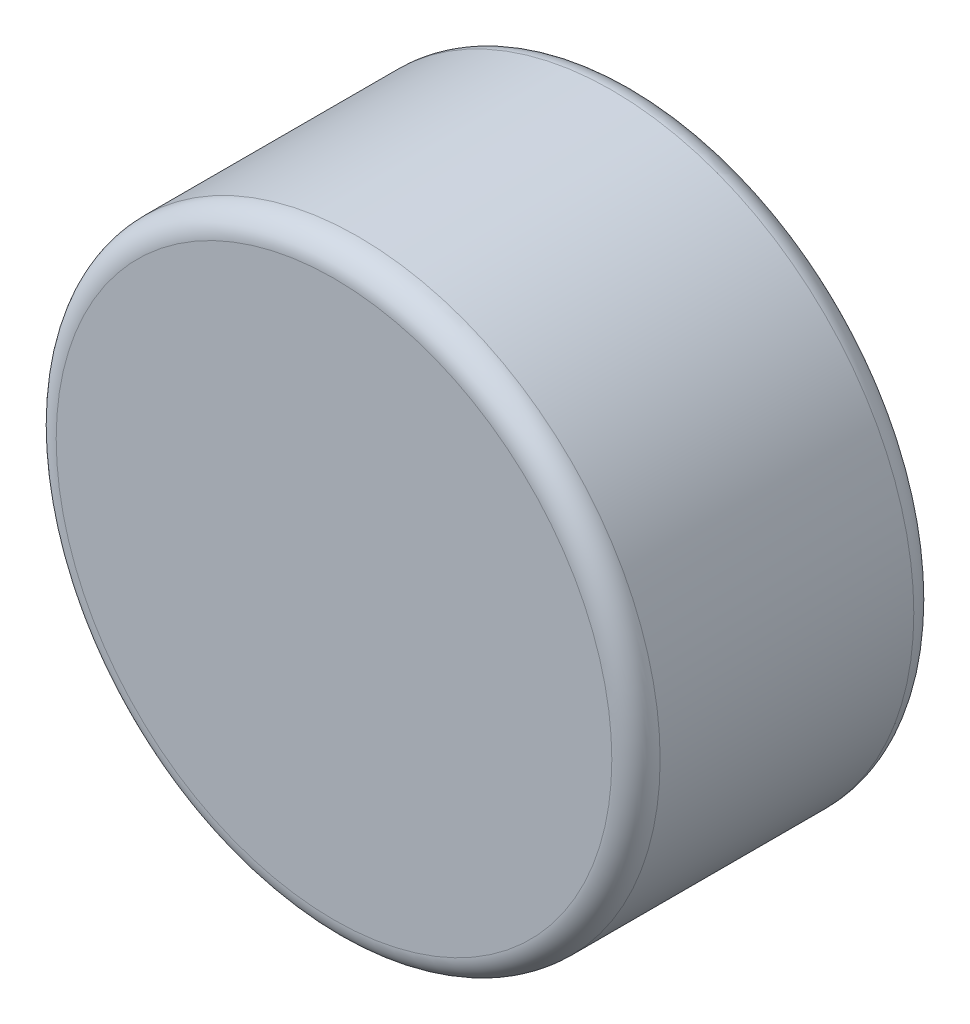
ISO-10303-21;
HEADER;
FILE_DESCRIPTION(('STEP AP214'),'2;1');
FILE_NAME('part.step','',(''),(''),'','','');
FILE_SCHEMA(('AUTOMOTIVE_DESIGN { 1 0 10303 214 1 1 1 1 }'));
ENDSEC;
DATA;
#1=APPLICATION_CONTEXT('core data for automotive mechanical design processes');
#2=APPLICATION_PROTOCOL_DEFINITION('international standard','automotive_design',2000,#1);
#3=PRODUCT_CONTEXT('',#1,'mechanical');
#4=PRODUCT('Part','Part','',(#3));
#5=PRODUCT_RELATED_PRODUCT_CATEGORY('part','',(#4));
#6=PRODUCT_DEFINITION_FORMATION('','',#4);
#7=PRODUCT_DEFINITION_CONTEXT('part definition',#1,'design');
#8=PRODUCT_DEFINITION('design','',#6,#7);
#9=PRODUCT_DEFINITION_SHAPE('','',#8);
#10=(LENGTH_UNIT() NAMED_UNIT(*) SI_UNIT(.MILLI.,.METRE.));
#11=(NAMED_UNIT(*) PLANE_ANGLE_UNIT() SI_UNIT($,.RADIAN.));
#12=(NAMED_UNIT(*) SI_UNIT($,.STERADIAN.) SOLID_ANGLE_UNIT());
#13=UNCERTAINTY_MEASURE_WITH_UNIT(LENGTH_MEASURE(1.E-05),#10,'distance_accuracy_value','');
#14=(GEOMETRIC_REPRESENTATION_CONTEXT(3) GLOBAL_UNCERTAINTY_ASSIGNED_CONTEXT((#13)) GLOBAL_UNIT_ASSIGNED_CONTEXT((#10,
#11,#12)) REPRESENTATION_CONTEXT('',''));
#15=CARTESIAN_POINT('',(0.,0.,0.));
#16=DIRECTION('',(0.,0.,1.));
#17=DIRECTION('',(1.,0.,0.));
#18=AXIS2_PLACEMENT_3D('',#15,#16,#17);
#19=CARTESIAN_POINT('',(0.,0.,2.5));
#20=DIRECTION('',(0.,0.,-1.));
#21=DIRECTION('',(-1.,0.,0.));
#22=AXIS2_PLACEMENT_3D('',#19,#20,#21);
#23=CYLINDRICAL_SURFACE('',#22,2.5);
#24=CARTESIAN_POINT('',(0.,0.,0.2));
#25=DIRECTION('',(0.,0.,1.));
#26=DIRECTION('',(1.,0.,0.));
#27=AXIS2_PLACEMENT_3D('',#24,#25,#26);
#28=CIRCLE('',#27,2.5);
#29=CARTESIAN_POINT('',(2.5,0.,0.2));
#30=VERTEX_POINT('',#29);
#31=EDGE_CURVE('E44',#30,#30,#28,.T.);
#32=ORIENTED_EDGE('',*,*,#31,.T.);
#33=EDGE_LOOP('',(#32));
#34=FACE_BOUND('',#33,.T.);
#35=CARTESIAN_POINT('',(0.,0.,2.3));
#36=DIRECTION('',(0.,0.,1.));
#37=DIRECTION('',(1.,0.,0.));
#38=AXIS2_PLACEMENT_3D('',#35,#36,#37);
#39=CIRCLE('',#38,2.5);
#40=CARTESIAN_POINT('',(2.5,0.,2.3));
#41=VERTEX_POINT('',#40);
#42=EDGE_CURVE('E48',#41,#41,#39,.F.);
#43=ORIENTED_EDGE('',*,*,#42,.T.);
#44=EDGE_LOOP('',(#43));
#45=FACE_BOUND('',#44,.T.);
#46=ADVANCED_FACE('F33',(#34,#45),#23,.T.);
#47=CARTESIAN_POINT('',(0.,0.,2.5));
#48=DIRECTION('',(0.,0.,1.));
#49=DIRECTION('',(1.,0.,0.));
#50=AXIS2_PLACEMENT_3D('',#47,#48,#49);
#51=PLANE('',#50);
#52=CARTESIAN_POINT('',(0.,0.,2.5));
#53=DIRECTION('',(0.,0.,1.));
#54=DIRECTION('',(1.,0.,0.));
#55=AXIS2_PLACEMENT_3D('',#52,#53,#54);
#56=CIRCLE('',#55,2.3);
#57=CARTESIAN_POINT('',(2.3,0.,2.5));
#58=VERTEX_POINT('',#57);
#59=EDGE_CURVE('E10',#58,#58,#56,.T.);
#60=ORIENTED_EDGE('',*,*,#59,.T.);
#61=EDGE_LOOP('',(#60));
#62=FACE_BOUND('',#61,.T.);
#63=ADVANCED_FACE('F64',(#62),#51,.T.);
#64=CARTESIAN_POINT('',(0.,0.,0.));
#65=DIRECTION('',(0.,0.,1.));
#66=DIRECTION('',(1.,0.,0.));
#67=AXIS2_PLACEMENT_3D('',#64,#65,#66);
#68=PLANE('',#67);
#69=CARTESIAN_POINT('',(0.,0.,0.));
#70=DIRECTION('',(0.,0.,1.));
#71=DIRECTION('',(1.,0.,0.));
#72=AXIS2_PLACEMENT_3D('',#69,#70,#71);
#73=CIRCLE('',#72,2.3);
#74=CARTESIAN_POINT('',(2.3,0.,0.));
#75=VERTEX_POINT('',#74);
#76=EDGE_CURVE('E40',#75,#75,#73,.F.);
#77=ORIENTED_EDGE('',*,*,#76,.T.);
#78=EDGE_LOOP('',(#77));
#79=FACE_BOUND('',#78,.T.);
#80=ADVANCED_FACE('F61',(#79),#68,.F.);
#81=CARTESIAN_POINT('',(0.,0.,0.2));
#82=DIRECTION('',(0.,0.,1.));
#83=DIRECTION('',(1.,0.,0.));
#84=AXIS2_PLACEMENT_3D('',#81,#82,#83);
#85=TOROIDAL_SURFACE('',#84,2.3,0.2);
#86=ORIENTED_EDGE('',*,*,#76,.F.);
#87=EDGE_LOOP('',(#86));
#88=FACE_BOUND('',#87,.T.);
#89=ORIENTED_EDGE('',*,*,#31,.F.);
#90=EDGE_LOOP('',(#89));
#91=FACE_BOUND('',#90,.T.);
#92=ADVANCED_FACE('F57',(#88,#91),#85,.T.);
#93=CARTESIAN_POINT('',(0.,0.,2.3));
#94=DIRECTION('',(0.,0.,1.));
#95=DIRECTION('',(1.,0.,0.));
#96=AXIS2_PLACEMENT_3D('',#93,#94,#95);
#97=TOROIDAL_SURFACE('',#96,2.3,0.2);
#98=ORIENTED_EDGE('',*,*,#42,.F.);
#99=EDGE_LOOP('',(#98));
#100=FACE_BOUND('',#99,.T.);
#101=ORIENTED_EDGE('',*,*,#59,.F.);
#102=EDGE_LOOP('',(#101));
#103=FACE_BOUND('',#102,.T.);
#104=ADVANCED_FACE('F35',(#100,#103),#97,.T.);
#105=CLOSED_SHELL('',(#46,#63,#80,#92,#104));
#106=MANIFOLD_SOLID_BREP('B2',#105);
#107=ADVANCED_BREP_SHAPE_REPRESENTATION('',(#18,#106),#14);
#108=SHAPE_DEFINITION_REPRESENTATION(#9,#107);
ENDSEC;
END-ISO-10303-21;
